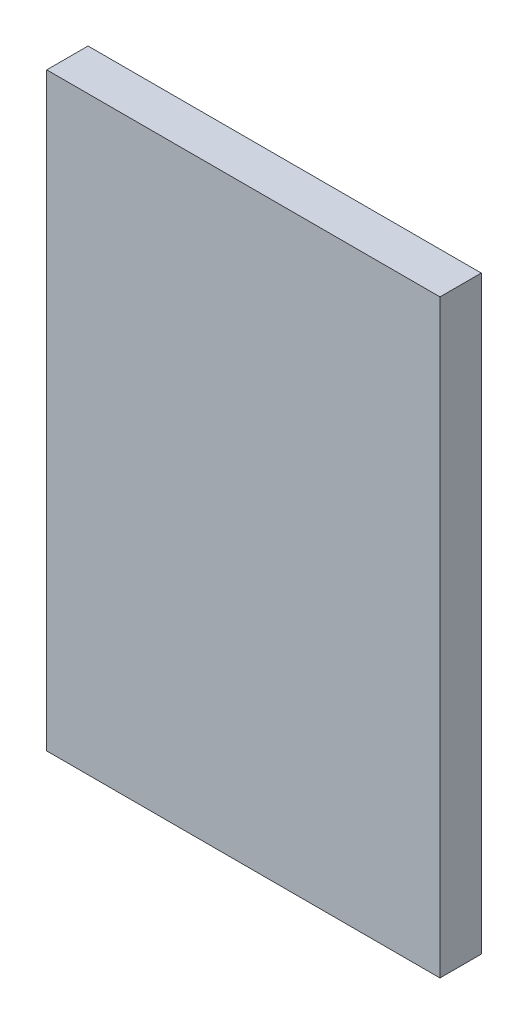
ISO-10303-21;
HEADER;
FILE_DESCRIPTION(('STEP AP214'),'2;1');
FILE_NAME('part.step','',(''),(''),'','','');
FILE_SCHEMA(('AUTOMOTIVE_DESIGN { 1 0 10303 214 1 1 1 1 }'));
ENDSEC;
DATA;
#1=APPLICATION_CONTEXT('core data for automotive mechanical design processes');
#2=APPLICATION_PROTOCOL_DEFINITION('international standard','automotive_design',2000,#1);
#3=PRODUCT_CONTEXT('',#1,'mechanical');
#4=PRODUCT('Part','Part','',(#3));
#5=PRODUCT_RELATED_PRODUCT_CATEGORY('part','',(#4));
#6=PRODUCT_DEFINITION_FORMATION('','',#4);
#7=PRODUCT_DEFINITION_CONTEXT('part definition',#1,'design');
#8=PRODUCT_DEFINITION('design','',#6,#7);
#9=PRODUCT_DEFINITION_SHAPE('','',#8);
#10=(LENGTH_UNIT() NAMED_UNIT(*) SI_UNIT(.MILLI.,.METRE.));
#11=(NAMED_UNIT(*) PLANE_ANGLE_UNIT() SI_UNIT($,.RADIAN.));
#12=(NAMED_UNIT(*) SI_UNIT($,.STERADIAN.) SOLID_ANGLE_UNIT());
#13=UNCERTAINTY_MEASURE_WITH_UNIT(LENGTH_MEASURE(1.E-05),#10,'distance_accuracy_value','');
#14=(GEOMETRIC_REPRESENTATION_CONTEXT(3) GLOBAL_UNCERTAINTY_ASSIGNED_CONTEXT((#13)) GLOBAL_UNIT_ASSIGNED_CONTEXT((#10,
#11,#12)) REPRESENTATION_CONTEXT('',''));
#15=CARTESIAN_POINT('',(0.,0.,0.));
#16=DIRECTION('',(0.,0.,1.));
#17=DIRECTION('',(1.,0.,0.));
#18=AXIS2_PLACEMENT_3D('',#15,#16,#17);
#19=CARTESIAN_POINT('',(0.,0.,21.));
#20=DIRECTION('',(1.,0.,0.));
#21=DIRECTION('',(0.,0.,-1.));
#22=AXIS2_PLACEMENT_3D('',#19,#20,#21);
#23=PLANE('',#22);
#24=DIRECTION('',(0.,-1.,0.));
#25=VECTOR('',#24,1.);
#26=CARTESIAN_POINT('',(0.,0.,0.));
#27=LINE('',#26,#25);
#28=CARTESIAN_POINT('',(0.,300.,0.));
#29=VERTEX_POINT('',#28);
#30=CARTESIAN_POINT('',(0.,0.,0.));
#31=VERTEX_POINT('',#30);
#32=EDGE_CURVE('E96',#29,#31,#27,.T.);
#33=ORIENTED_EDGE('',*,*,#32,.T.);
#34=DIRECTION('',(0.,0.,-1.));
#35=VECTOR('',#34,1.);
#36=CARTESIAN_POINT('',(0.,0.,21.));
#37=LINE('',#36,#35);
#38=CARTESIAN_POINT('',(0.,0.,21.));
#39=VERTEX_POINT('',#38);
#40=EDGE_CURVE('E11',#39,#31,#37,.T.);
#41=ORIENTED_EDGE('',*,*,#40,.F.);
#42=DIRECTION('',(0.,-1.,0.));
#43=VECTOR('',#42,1.);
#44=CARTESIAN_POINT('',(0.,0.,21.));
#45=LINE('',#44,#43);
#46=CARTESIAN_POINT('',(0.,300.,21.));
#47=VERTEX_POINT('',#46);
#48=EDGE_CURVE('E84',#47,#39,#45,.T.);
#49=ORIENTED_EDGE('',*,*,#48,.F.);
#50=DIRECTION('',(0.,0.,-1.));
#51=VECTOR('',#50,1.);
#52=CARTESIAN_POINT('',(0.,300.,21.));
#53=LINE('',#52,#51);
#54=EDGE_CURVE('E92',#47,#29,#53,.T.);
#55=ORIENTED_EDGE('',*,*,#54,.T.);
#56=EDGE_LOOP('',(#33,#41,#49,#55));
#57=FACE_BOUND('',#56,.T.);
#58=ADVANCED_FACE('F33',(#57),#23,.F.);
#59=CARTESIAN_POINT('',(0.,0.,21.));
#60=DIRECTION('',(0.,1.,0.));
#61=DIRECTION('',(0.,0.,1.));
#62=AXIS2_PLACEMENT_3D('',#59,#60,#61);
#63=PLANE('',#62);
#64=DIRECTION('',(1.,0.,0.));
#65=VECTOR('',#64,1.);
#66=CARTESIAN_POINT('',(0.,0.,0.));
#67=LINE('',#66,#65);
#68=CARTESIAN_POINT('',(200.,0.,0.));
#69=VERTEX_POINT('',#68);
#70=EDGE_CURVE('E88',#31,#69,#67,.T.);
#71=ORIENTED_EDGE('',*,*,#70,.T.);
#72=DIRECTION('',(0.,0.,-1.));
#73=VECTOR('',#72,1.);
#74=CARTESIAN_POINT('',(200.,0.,21.));
#75=LINE('',#74,#73);
#76=CARTESIAN_POINT('',(200.,0.,21.));
#77=VERTEX_POINT('',#76);
#78=EDGE_CURVE('E41',#77,#69,#75,.T.);
#79=ORIENTED_EDGE('',*,*,#78,.F.);
#80=DIRECTION('',(1.,0.,0.));
#81=VECTOR('',#80,1.);
#82=CARTESIAN_POINT('',(0.,0.,21.));
#83=LINE('',#82,#81);
#84=EDGE_CURVE('E79',#39,#77,#83,.T.);
#85=ORIENTED_EDGE('',*,*,#84,.F.);
#86=ORIENTED_EDGE('',*,*,#40,.T.);
#87=EDGE_LOOP('',(#71,#79,#85,#86));
#88=FACE_BOUND('',#87,.T.);
#89=ADVANCED_FACE('F87',(#88),#63,.F.);
#90=CARTESIAN_POINT('',(200.,0.,21.));
#91=DIRECTION('',(-1.,0.,0.));
#92=DIRECTION('',(0.,0.,1.));
#93=AXIS2_PLACEMENT_3D('',#90,#91,#92);
#94=PLANE('',#93);
#95=DIRECTION('',(0.,1.,0.));
#96=VECTOR('',#95,1.);
#97=CARTESIAN_POINT('',(200.,0.,0.));
#98=LINE('',#97,#96);
#99=CARTESIAN_POINT('',(200.,300.,0.));
#100=VERTEX_POINT('',#99);
#101=EDGE_CURVE('E66',#69,#100,#98,.T.);
#102=ORIENTED_EDGE('',*,*,#101,.T.);
#103=DIRECTION('',(0.,0.,-1.));
#104=VECTOR('',#103,1.);
#105=CARTESIAN_POINT('',(200.,300.,21.));
#106=LINE('',#105,#104);
#107=CARTESIAN_POINT('',(200.,300.,21.));
#108=VERTEX_POINT('',#107);
#109=EDGE_CURVE('E89',#108,#100,#106,.T.);
#110=ORIENTED_EDGE('',*,*,#109,.F.);
#111=DIRECTION('',(0.,1.,0.));
#112=VECTOR('',#111,1.);
#113=CARTESIAN_POINT('',(200.,0.,21.));
#114=LINE('',#113,#112);
#115=EDGE_CURVE('E82',#77,#108,#114,.T.);
#116=ORIENTED_EDGE('',*,*,#115,.F.);
#117=ORIENTED_EDGE('',*,*,#78,.T.);
#118=EDGE_LOOP('',(#102,#110,#116,#117));
#119=FACE_BOUND('',#118,.T.);
#120=ADVANCED_FACE('F90',(#119),#94,.F.);
#121=CARTESIAN_POINT('',(0.,300.,21.));
#122=DIRECTION('',(0.,-1.,0.));
#123=DIRECTION('',(0.,0.,-1.));
#124=AXIS2_PLACEMENT_3D('',#121,#122,#123);
#125=PLANE('',#124);
#126=DIRECTION('',(-1.,0.,0.));
#127=VECTOR('',#126,1.);
#128=CARTESIAN_POINT('',(0.,300.,0.));
#129=LINE('',#128,#127);
#130=EDGE_CURVE('E72',#100,#29,#129,.T.);
#131=ORIENTED_EDGE('',*,*,#130,.T.);
#132=ORIENTED_EDGE('',*,*,#54,.F.);
#133=DIRECTION('',(-1.,0.,0.));
#134=VECTOR('',#133,1.);
#135=CARTESIAN_POINT('',(0.,300.,21.));
#136=LINE('',#135,#134);
#137=EDGE_CURVE('E49',#108,#47,#136,.T.);
#138=ORIENTED_EDGE('',*,*,#137,.F.);
#139=ORIENTED_EDGE('',*,*,#109,.T.);
#140=EDGE_LOOP('',(#131,#132,#138,#139));
#141=FACE_BOUND('',#140,.T.);
#142=ADVANCED_FACE('F103',(#141),#125,.F.);
#143=CARTESIAN_POINT('',(0.,0.,21.));
#144=DIRECTION('',(0.,0.,-1.));
#145=DIRECTION('',(-1.,0.,0.));
#146=AXIS2_PLACEMENT_3D('',#143,#144,#145);
#147=PLANE('',#146);
#148=ORIENTED_EDGE('',*,*,#48,.T.);
#149=ORIENTED_EDGE('',*,*,#84,.T.);
#150=ORIENTED_EDGE('',*,*,#115,.T.);
#151=ORIENTED_EDGE('',*,*,#137,.T.);
#152=EDGE_LOOP('',(#148,#149,#150,#151));
#153=FACE_BOUND('',#152,.T.);
#154=ADVANCED_FACE('F80',(#153),#147,.F.);
#155=CARTESIAN_POINT('',(0.,0.,0.));
#156=DIRECTION('',(0.,0.,-1.));
#157=DIRECTION('',(-1.,0.,0.));
#158=AXIS2_PLACEMENT_3D('',#155,#156,#157);
#159=PLANE('',#158);
#160=ORIENTED_EDGE('',*,*,#32,.F.);
#161=ORIENTED_EDGE('',*,*,#130,.F.);
#162=ORIENTED_EDGE('',*,*,#101,.F.);
#163=ORIENTED_EDGE('',*,*,#70,.F.);
#164=EDGE_LOOP('',(#160,#161,#162,#163));
#165=FACE_BOUND('',#164,.T.);
#166=ADVANCED_FACE('F106',(#165),#159,.T.);
#167=CLOSED_SHELL('',(#58,#89,#120,#142,#154,#166));
#168=MANIFOLD_SOLID_BREP('B2',#167);
#169=ADVANCED_BREP_SHAPE_REPRESENTATION('',(#18,#168),#14);
#170=SHAPE_DEFINITION_REPRESENTATION(#9,#169);
ENDSEC;
END-ISO-10303-21;
